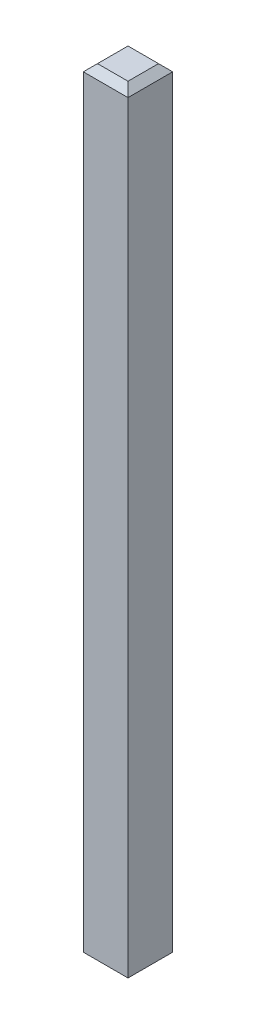
ISO-10303-21;
HEADER;
FILE_DESCRIPTION(('STEP AP214'),'2;1');
FILE_NAME('part.step','',(''),(''),'','','');
FILE_SCHEMA(('AUTOMOTIVE_DESIGN { 1 0 10303 214 1 1 1 1 }'));
ENDSEC;
DATA;
#1=APPLICATION_CONTEXT('core data for automotive mechanical design processes');
#2=APPLICATION_PROTOCOL_DEFINITION('international standard','automotive_design',2000,#1);
#3=PRODUCT_CONTEXT('',#1,'mechanical');
#4=PRODUCT('Part','Part','',(#3));
#5=PRODUCT_RELATED_PRODUCT_CATEGORY('part','',(#4));
#6=PRODUCT_DEFINITION_FORMATION('','',#4);
#7=PRODUCT_DEFINITION_CONTEXT('part definition',#1,'design');
#8=PRODUCT_DEFINITION('design','',#6,#7);
#9=PRODUCT_DEFINITION_SHAPE('','',#8);
#10=(LENGTH_UNIT() NAMED_UNIT(*) SI_UNIT(.MILLI.,.METRE.));
#11=(NAMED_UNIT(*) PLANE_ANGLE_UNIT() SI_UNIT($,.RADIAN.));
#12=(NAMED_UNIT(*) SI_UNIT($,.STERADIAN.) SOLID_ANGLE_UNIT());
#13=UNCERTAINTY_MEASURE_WITH_UNIT(LENGTH_MEASURE(1.E-05),#10,'distance_accuracy_value','');
#14=(GEOMETRIC_REPRESENTATION_CONTEXT(3) GLOBAL_UNCERTAINTY_ASSIGNED_CONTEXT((#13)) GLOBAL_UNIT_ASSIGNED_CONTEXT((#10,
#11,#12)) REPRESENTATION_CONTEXT('',''));
#15=CARTESIAN_POINT('',(0.,0.,0.));
#16=DIRECTION('',(0.,0.,1.));
#17=DIRECTION('',(1.,0.,0.));
#18=AXIS2_PLACEMENT_3D('',#15,#16,#17);
#19=CARTESIAN_POINT('',(0.315,10.95,-0.315));
#20=DIRECTION('',(-1.,0.,0.));
#21=DIRECTION('',(0.,0.,1.));
#22=AXIS2_PLACEMENT_3D('',#19,#20,#21);
#23=PLANE('',#22);
#24=DIRECTION('',(0.,-1.,0.));
#25=VECTOR('',#24,1.);
#26=CARTESIAN_POINT('',(0.315,10.95,0.315));
#27=LINE('',#26,#25);
#28=CARTESIAN_POINT('',(0.315,10.85,0.315));
#29=VERTEX_POINT('',#28);
#30=CARTESIAN_POINT('',(0.315,0.100000000000001,0.315));
#31=VERTEX_POINT('',#30);
#32=EDGE_CURVE('E148',#29,#31,#27,.T.);
#33=ORIENTED_EDGE('',*,*,#32,.T.);
#34=DIRECTION('',(0.,0.,-1.));
#35=VECTOR('',#34,1.);
#36=CARTESIAN_POINT('',(0.315,0.100000000000001,-0.315));
#37=LINE('',#36,#35);
#38=CARTESIAN_POINT('',(0.315,0.100000000000001,-0.315));
#39=VERTEX_POINT('',#38);
#40=EDGE_CURVE('E157',#31,#39,#37,.T.);
#41=ORIENTED_EDGE('',*,*,#40,.T.);
#42=DIRECTION('',(0.,-1.,0.));
#43=VECTOR('',#42,1.);
#44=CARTESIAN_POINT('',(0.315,10.95,-0.315));
#45=LINE('',#44,#43);
#46=CARTESIAN_POINT('',(0.315,10.85,-0.315));
#47=VERTEX_POINT('',#46);
#48=EDGE_CURVE('E126',#47,#39,#45,.T.);
#49=ORIENTED_EDGE('',*,*,#48,.F.);
#50=DIRECTION('',(0.,0.,1.));
#51=VECTOR('',#50,1.);
#52=CARTESIAN_POINT('',(0.315,10.85,0.315));
#53=LINE('',#52,#51);
#54=EDGE_CURVE('E159',#47,#29,#53,.T.);
#55=ORIENTED_EDGE('',*,*,#54,.T.);
#56=EDGE_LOOP('',(#33,#41,#49,#55));
#57=FACE_BOUND('',#56,.T.);
#58=ADVANCED_FACE('F38',(#57),#23,.F.);
#59=CARTESIAN_POINT('',(-0.315,10.95,-0.315));
#60=DIRECTION('',(0.,0.,1.));
#61=DIRECTION('',(1.,0.,0.));
#62=AXIS2_PLACEMENT_3D('',#59,#60,#61);
#63=PLANE('',#62);
#64=ORIENTED_EDGE('',*,*,#48,.T.);
#65=DIRECTION('',(-1.,0.,0.));
#66=VECTOR('',#65,1.);
#67=CARTESIAN_POINT('',(-0.315,0.100000000000001,-0.315));
#68=LINE('',#67,#66);
#69=CARTESIAN_POINT('',(-0.315,0.100000000000001,-0.315));
#70=VERTEX_POINT('',#69);
#71=EDGE_CURVE('E125',#39,#70,#68,.T.);
#72=ORIENTED_EDGE('',*,*,#71,.T.);
#73=DIRECTION('',(0.,-1.,0.));
#74=VECTOR('',#73,1.);
#75=CARTESIAN_POINT('',(-0.315,10.95,-0.315));
#76=LINE('',#75,#74);
#77=CARTESIAN_POINT('',(-0.315,10.85,-0.315));
#78=VERTEX_POINT('',#77);
#79=EDGE_CURVE('E108',#78,#70,#76,.T.);
#80=ORIENTED_EDGE('',*,*,#79,.F.);
#81=DIRECTION('',(1.,0.,0.));
#82=VECTOR('',#81,1.);
#83=CARTESIAN_POINT('',(0.315,10.85,-0.315));
#84=LINE('',#83,#82);
#85=EDGE_CURVE('E122',#78,#47,#84,.T.);
#86=ORIENTED_EDGE('',*,*,#85,.T.);
#87=EDGE_LOOP('',(#64,#72,#80,#86));
#88=FACE_BOUND('',#87,.T.);
#89=ADVANCED_FACE('F121',(#88),#63,.F.);
#90=CARTESIAN_POINT('',(-0.315,10.95,-0.315));
#91=DIRECTION('',(1.,0.,0.));
#92=DIRECTION('',(0.,0.,-1.));
#93=AXIS2_PLACEMENT_3D('',#90,#91,#92);
#94=PLANE('',#93);
#95=ORIENTED_EDGE('',*,*,#79,.T.);
#96=DIRECTION('',(0.,0.,1.));
#97=VECTOR('',#96,1.);
#98=CARTESIAN_POINT('',(-0.315,0.100000000000001,-0.315));
#99=LINE('',#98,#97);
#100=CARTESIAN_POINT('',(-0.315,0.100000000000001,0.315));
#101=VERTEX_POINT('',#100);
#102=EDGE_CURVE('E114',#70,#101,#99,.T.);
#103=ORIENTED_EDGE('',*,*,#102,.T.);
#104=DIRECTION('',(0.,-1.,0.));
#105=VECTOR('',#104,1.);
#106=CARTESIAN_POINT('',(-0.315,10.95,0.315));
#107=LINE('',#106,#105);
#108=CARTESIAN_POINT('',(-0.315,10.85,0.315));
#109=VERTEX_POINT('',#108);
#110=EDGE_CURVE('E110',#109,#101,#107,.T.);
#111=ORIENTED_EDGE('',*,*,#110,.F.);
#112=DIRECTION('',(0.,0.,-1.));
#113=VECTOR('',#112,1.);
#114=CARTESIAN_POINT('',(-0.315,10.85,-0.315));
#115=LINE('',#114,#113);
#116=EDGE_CURVE('E105',#109,#78,#115,.T.);
#117=ORIENTED_EDGE('',*,*,#116,.T.);
#118=EDGE_LOOP('',(#95,#103,#111,#117));
#119=FACE_BOUND('',#118,.T.);
#120=ADVANCED_FACE('F107',(#119),#94,.F.);
#121=CARTESIAN_POINT('',(-0.315,10.95,0.315));
#122=DIRECTION('',(0.,0.,-1.));
#123=DIRECTION('',(-1.,0.,0.));
#124=AXIS2_PLACEMENT_3D('',#121,#122,#123);
#125=PLANE('',#124);
#126=ORIENTED_EDGE('',*,*,#110,.T.);
#127=DIRECTION('',(1.,0.,0.));
#128=VECTOR('',#127,1.);
#129=CARTESIAN_POINT('',(-0.315,0.100000000000001,0.315));
#130=LINE('',#129,#128);
#131=EDGE_CURVE('E161',#101,#31,#130,.T.);
#132=ORIENTED_EDGE('',*,*,#131,.T.);
#133=ORIENTED_EDGE('',*,*,#32,.F.);
#134=DIRECTION('',(-1.,0.,0.));
#135=VECTOR('',#134,1.);
#136=CARTESIAN_POINT('',(-0.315,10.85,0.315));
#137=LINE('',#136,#135);
#138=EDGE_CURVE('E163',#29,#109,#137,.T.);
#139=ORIENTED_EDGE('',*,*,#138,.T.);
#140=EDGE_LOOP('',(#126,#132,#133,#139));
#141=FACE_BOUND('',#140,.T.);
#142=ADVANCED_FACE('F201',(#141),#125,.F.);
#143=CARTESIAN_POINT('',(0.,10.95,0.));
#144=DIRECTION('',(0.,1.,0.));
#145=DIRECTION('',(0.,0.,1.));
#146=AXIS2_PLACEMENT_3D('',#143,#144,#145);
#147=PLANE('',#146);
#148=DIRECTION('',(0.,0.,1.));
#149=VECTOR('',#148,1.);
#150=CARTESIAN_POINT('',(-0.215,10.95,0.315));
#151=LINE('',#150,#149);
#152=CARTESIAN_POINT('',(-0.215,10.95,-0.215));
#153=VERTEX_POINT('',#152);
#154=CARTESIAN_POINT('',(-0.215,10.95,0.215));
#155=VERTEX_POINT('',#154);
#156=EDGE_CURVE('E48',#153,#155,#151,.T.);
#157=ORIENTED_EDGE('',*,*,#156,.T.);
#158=DIRECTION('',(1.,0.,0.));
#159=VECTOR('',#158,1.);
#160=CARTESIAN_POINT('',(0.315,10.95,0.215));
#161=LINE('',#160,#159);
#162=CARTESIAN_POINT('',(0.215,10.95,0.215));
#163=VERTEX_POINT('',#162);
#164=EDGE_CURVE('E11',#155,#163,#161,.T.);
#165=ORIENTED_EDGE('',*,*,#164,.T.);
#166=DIRECTION('',(0.,0.,-1.));
#167=VECTOR('',#166,1.);
#168=CARTESIAN_POINT('',(0.215,10.95,-0.315));
#169=LINE('',#168,#167);
#170=CARTESIAN_POINT('',(0.215,10.95,-0.215));
#171=VERTEX_POINT('',#170);
#172=EDGE_CURVE('E155',#163,#171,#169,.T.);
#173=ORIENTED_EDGE('',*,*,#172,.T.);
#174=DIRECTION('',(-1.,0.,0.));
#175=VECTOR('',#174,1.);
#176=CARTESIAN_POINT('',(-0.315,10.95,-0.215));
#177=LINE('',#176,#175);
#178=EDGE_CURVE('E59',#171,#153,#177,.T.);
#179=ORIENTED_EDGE('',*,*,#178,.T.);
#180=EDGE_LOOP('',(#157,#165,#173,#179));
#181=FACE_BOUND('',#180,.T.);
#182=ADVANCED_FACE('F207',(#181),#147,.T.);
#183=CARTESIAN_POINT('',(0.,0.,0.));
#184=DIRECTION('',(0.,1.,0.));
#185=DIRECTION('',(0.,0.,1.));
#186=AXIS2_PLACEMENT_3D('',#183,#184,#185);
#187=PLANE('',#186);
#188=DIRECTION('',(0.,0.,-1.));
#189=VECTOR('',#188,1.);
#190=CARTESIAN_POINT('',(-0.215000000000001,0.,0.));
#191=LINE('',#190,#189);
#192=CARTESIAN_POINT('',(-0.215,0.,0.215000000000001));
#193=VERTEX_POINT('',#192);
#194=CARTESIAN_POINT('',(-0.215000000000001,0.,-0.215000000000001));
#195=VERTEX_POINT('',#194);
#196=EDGE_CURVE('E168',#193,#195,#191,.T.);
#197=ORIENTED_EDGE('',*,*,#196,.T.);
#198=DIRECTION('',(1.,0.,0.));
#199=VECTOR('',#198,1.);
#200=CARTESIAN_POINT('',(0.,0.,-0.215000000000001));
#201=LINE('',#200,#199);
#202=CARTESIAN_POINT('',(0.215000000000001,0.,-0.215000000000001));
#203=VERTEX_POINT('',#202);
#204=EDGE_CURVE('E115',#195,#203,#201,.T.);
#205=ORIENTED_EDGE('',*,*,#204,.T.);
#206=DIRECTION('',(0.,0.,1.));
#207=VECTOR('',#206,1.);
#208=CARTESIAN_POINT('',(0.215000000000001,0.,0.));
#209=LINE('',#208,#207);
#210=CARTESIAN_POINT('',(0.215000000000001,0.,0.215000000000001));
#211=VERTEX_POINT('',#210);
#212=EDGE_CURVE('E172',#203,#211,#209,.T.);
#213=ORIENTED_EDGE('',*,*,#212,.T.);
#214=DIRECTION('',(-1.,0.,0.));
#215=VECTOR('',#214,1.);
#216=CARTESIAN_POINT('',(0.,0.,0.215000000000001));
#217=LINE('',#216,#215);
#218=EDGE_CURVE('E170',#211,#193,#217,.T.);
#219=ORIENTED_EDGE('',*,*,#218,.T.);
#220=EDGE_LOOP('',(#197,#205,#213,#219));
#221=FACE_BOUND('',#220,.T.);
#222=ADVANCED_FACE('F209',(#221),#187,.F.);
#223=CARTESIAN_POINT('',(-0.315,0.100000000000001,0.315));
#224=DIRECTION('',(0.,0.707106781186541,-0.707106781186554));
#225=DIRECTION('',(1.,0.,0.));
#226=AXIS2_PLACEMENT_3D('',#223,#224,#225);
#227=PLANE('',#226);
#228=DIRECTION('',(0.577350269189622,-0.577350269189632,-0.577350269189622));
#229=VECTOR('',#228,1.);
#230=CARTESIAN_POINT('',(-0.315,0.100000000000001,0.315));
#231=LINE('',#230,#229);
#232=EDGE_CURVE('E149',#193,#101,#231,.F.);
#233=ORIENTED_EDGE('',*,*,#232,.F.);
#234=ORIENTED_EDGE('',*,*,#218,.F.);
#235=DIRECTION('',(-0.577350269189622,-0.577350269189632,-0.577350269189622));
#236=VECTOR('',#235,1.);
#237=CARTESIAN_POINT('',(0.105000000000003,-0.11,0.105000000000002));
#238=LINE('',#237,#236);
#239=EDGE_CURVE('E145',#31,#211,#238,.T.);
#240=ORIENTED_EDGE('',*,*,#239,.F.);
#241=ORIENTED_EDGE('',*,*,#131,.F.);
#242=EDGE_LOOP('',(#233,#234,#240,#241));
#243=FACE_BOUND('',#242,.T.);
#244=ADVANCED_FACE('F188',(#243),#227,.F.);
#245=CARTESIAN_POINT('',(0.315,0.100000000000001,-0.315));
#246=DIRECTION('',(-0.707106781186554,0.707106781186541,0.));
#247=DIRECTION('',(0.,0.,-1.));
#248=AXIS2_PLACEMENT_3D('',#245,#246,#247);
#249=PLANE('',#248);
#250=ORIENTED_EDGE('',*,*,#239,.T.);
#251=ORIENTED_EDGE('',*,*,#212,.F.);
#252=DIRECTION('',(0.577350269189622,0.577350269189632,-0.577350269189622));
#253=VECTOR('',#252,1.);
#254=CARTESIAN_POINT('',(0.315,0.100000000000001,-0.315));
#255=LINE('',#254,#253);
#256=EDGE_CURVE('E136',#39,#203,#255,.F.);
#257=ORIENTED_EDGE('',*,*,#256,.F.);
#258=ORIENTED_EDGE('',*,*,#40,.F.);
#259=EDGE_LOOP('',(#250,#251,#257,#258));
#260=FACE_BOUND('',#259,.T.);
#261=ADVANCED_FACE('F192',(#260),#249,.F.);
#262=CARTESIAN_POINT('',(-0.315,0.100000000000001,-0.315));
#263=DIRECTION('',(0.707106781186554,0.707106781186541,0.));
#264=DIRECTION('',(0.,0.,1.));
#265=AXIS2_PLACEMENT_3D('',#262,#263,#264);
#266=PLANE('',#265);
#267=ORIENTED_EDGE('',*,*,#232,.T.);
#268=ORIENTED_EDGE('',*,*,#102,.F.);
#269=DIRECTION('',(0.577350269189622,-0.577350269189632,0.577350269189622));
#270=VECTOR('',#269,1.);
#271=CARTESIAN_POINT('',(-0.315,0.100000000000001,-0.315));
#272=LINE('',#271,#270);
#273=EDGE_CURVE('E135',#195,#70,#272,.F.);
#274=ORIENTED_EDGE('',*,*,#273,.F.);
#275=ORIENTED_EDGE('',*,*,#196,.F.);
#276=EDGE_LOOP('',(#267,#268,#274,#275));
#277=FACE_BOUND('',#276,.T.);
#278=ADVANCED_FACE('F200',(#277),#266,.F.);
#279=CARTESIAN_POINT('',(-0.315,0.100000000000001,-0.315));
#280=DIRECTION('',(0.,0.707106781186541,0.707106781186554));
#281=DIRECTION('',(-1.,0.,0.));
#282=AXIS2_PLACEMENT_3D('',#279,#280,#281);
#283=PLANE('',#282);
#284=ORIENTED_EDGE('',*,*,#256,.T.);
#285=ORIENTED_EDGE('',*,*,#204,.F.);
#286=ORIENTED_EDGE('',*,*,#273,.T.);
#287=ORIENTED_EDGE('',*,*,#71,.F.);
#288=EDGE_LOOP('',(#284,#285,#286,#287));
#289=FACE_BOUND('',#288,.T.);
#290=ADVANCED_FACE('F195',(#289),#283,.F.);
#291=CARTESIAN_POINT('',(0.,10.95,-0.215));
#292=DIRECTION('',(0.,0.707106781186544,-0.707106781186551));
#293=DIRECTION('',(1.,0.,0.));
#294=AXIS2_PLACEMENT_3D('',#291,#292,#293);
#295=PLANE('',#294);
#296=DIRECTION('',(-0.577350269189624,0.577350269189629,0.577350269189624));
#297=VECTOR('',#296,1.);
#298=CARTESIAN_POINT('',(0.143333333333334,11.0216666666667,-0.143333333333334));
#299=LINE('',#298,#297);
#300=EDGE_CURVE('E131',#47,#171,#299,.T.);
#301=ORIENTED_EDGE('',*,*,#300,.F.);
#302=ORIENTED_EDGE('',*,*,#85,.F.);
#303=DIRECTION('',(0.577350269189624,0.577350269189629,0.577350269189624));
#304=VECTOR('',#303,1.);
#305=CARTESIAN_POINT('',(-0.143333333333334,11.0216666666667,-0.143333333333334));
#306=LINE('',#305,#304);
#307=EDGE_CURVE('E43',#153,#78,#306,.F.);
#308=ORIENTED_EDGE('',*,*,#307,.F.);
#309=ORIENTED_EDGE('',*,*,#178,.F.);
#310=EDGE_LOOP('',(#301,#302,#308,#309));
#311=FACE_BOUND('',#310,.T.);
#312=ADVANCED_FACE('F41',(#311),#295,.T.);
#313=CARTESIAN_POINT('',(-0.215,10.95,0.));
#314=DIRECTION('',(-0.707106781186551,0.707106781186544,0.));
#315=DIRECTION('',(0.,0.,-1.));
#316=AXIS2_PLACEMENT_3D('',#313,#314,#315);
#317=PLANE('',#316);
#318=ORIENTED_EDGE('',*,*,#307,.T.);
#319=ORIENTED_EDGE('',*,*,#116,.F.);
#320=DIRECTION('',(0.577350269189624,0.577350269189629,-0.577350269189624));
#321=VECTOR('',#320,1.);
#322=CARTESIAN_POINT('',(-0.143333333333333,11.0216666666667,0.143333333333334));
#323=LINE('',#322,#321);
#324=EDGE_CURVE('E138',#155,#109,#323,.F.);
#325=ORIENTED_EDGE('',*,*,#324,.F.);
#326=ORIENTED_EDGE('',*,*,#156,.F.);
#327=EDGE_LOOP('',(#318,#319,#325,#326));
#328=FACE_BOUND('',#327,.T.);
#329=ADVANCED_FACE('F134',(#328),#317,.T.);
#330=CARTESIAN_POINT('',(0.215,10.95,0.));
#331=DIRECTION('',(0.707106781186551,0.707106781186544,0.));
#332=DIRECTION('',(0.,0.,1.));
#333=AXIS2_PLACEMENT_3D('',#330,#331,#332);
#334=PLANE('',#333);
#335=ORIENTED_EDGE('',*,*,#300,.T.);
#336=ORIENTED_EDGE('',*,*,#172,.F.);
#337=DIRECTION('',(0.577350269189624,-0.577350269189629,0.577350269189624));
#338=VECTOR('',#337,1.);
#339=CARTESIAN_POINT('',(0.143333333333334,11.0216666666667,0.143333333333334));
#340=LINE('',#339,#338);
#341=EDGE_CURVE('E141',#29,#163,#340,.F.);
#342=ORIENTED_EDGE('',*,*,#341,.F.);
#343=ORIENTED_EDGE('',*,*,#54,.F.);
#344=EDGE_LOOP('',(#335,#336,#342,#343));
#345=FACE_BOUND('',#344,.T.);
#346=ADVANCED_FACE('F206',(#345),#334,.T.);
#347=CARTESIAN_POINT('',(0.,10.95,0.215));
#348=DIRECTION('',(0.,0.707106781186544,0.707106781186551));
#349=DIRECTION('',(-1.,0.,0.));
#350=AXIS2_PLACEMENT_3D('',#347,#348,#349);
#351=PLANE('',#350);
#352=ORIENTED_EDGE('',*,*,#324,.T.);
#353=ORIENTED_EDGE('',*,*,#138,.F.);
#354=ORIENTED_EDGE('',*,*,#341,.T.);
#355=ORIENTED_EDGE('',*,*,#164,.F.);
#356=EDGE_LOOP('',(#352,#353,#354,#355));
#357=FACE_BOUND('',#356,.T.);
#358=ADVANCED_FACE('F204',(#357),#351,.T.);
#359=CLOSED_SHELL('',(#58,#89,#120,#142,#182,#222,#244,#261,#278,#290,#312,#329,#346,#358));
#360=MANIFOLD_SOLID_BREP('B2',#359);
#361=ADVANCED_BREP_SHAPE_REPRESENTATION('',(#18,#360),#14);
#362=SHAPE_DEFINITION_REPRESENTATION(#9,#361);
ENDSEC;
END-ISO-10303-21;
